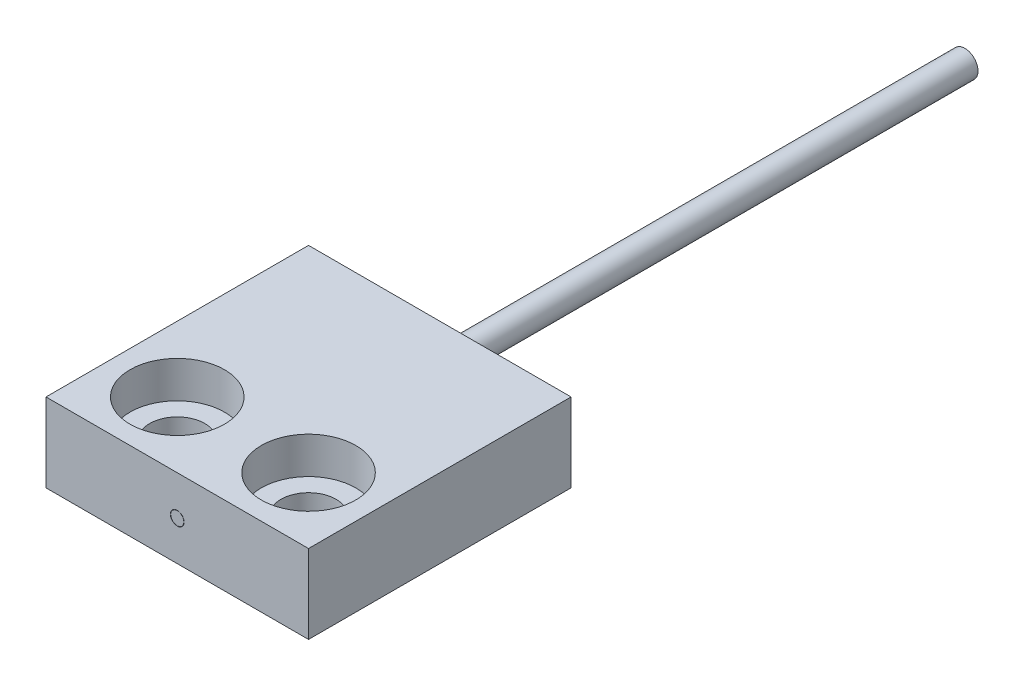
ISO-10303-21;
HEADER;
FILE_DESCRIPTION(('STEP AP214'),'2;1');
FILE_NAME('part.step','',(''),(''),'','','');
FILE_SCHEMA(('AUTOMOTIVE_DESIGN { 1 0 10303 214 1 1 1 1 }'));
ENDSEC;
DATA;
#1=APPLICATION_CONTEXT('core data for automotive mechanical design processes');
#2=APPLICATION_PROTOCOL_DEFINITION('international standard','automotive_design',2000,#1);
#3=PRODUCT_CONTEXT('',#1,'mechanical');
#4=PRODUCT('Part','Part','',(#3));
#5=PRODUCT_RELATED_PRODUCT_CATEGORY('part','',(#4));
#6=PRODUCT_DEFINITION_FORMATION('','',#4);
#7=PRODUCT_DEFINITION_CONTEXT('part definition',#1,'design');
#8=PRODUCT_DEFINITION('design','',#6,#7);
#9=PRODUCT_DEFINITION_SHAPE('','',#8);
#10=(LENGTH_UNIT() NAMED_UNIT(*) SI_UNIT(.MILLI.,.METRE.));
#11=(NAMED_UNIT(*) PLANE_ANGLE_UNIT() SI_UNIT($,.RADIAN.));
#12=(NAMED_UNIT(*) SI_UNIT($,.STERADIAN.) SOLID_ANGLE_UNIT());
#13=UNCERTAINTY_MEASURE_WITH_UNIT(LENGTH_MEASURE(1.E-05),#10,'distance_accuracy_value','');
#14=(GEOMETRIC_REPRESENTATION_CONTEXT(3) GLOBAL_UNCERTAINTY_ASSIGNED_CONTEXT((#13)) GLOBAL_UNIT_ASSIGNED_CONTEXT((#10,
#11,#12)) REPRESENTATION_CONTEXT('',''));
#15=CARTESIAN_POINT('',(0.,0.,0.));
#16=DIRECTION('',(0.,0.,1.));
#17=DIRECTION('',(1.,0.,0.));
#18=AXIS2_PLACEMENT_3D('',#15,#16,#17);
#19=CARTESIAN_POINT('',(20.,1.50000000000004,0.));
#20=DIRECTION('',(0.,0.,1.));
#21=DIRECTION('',(0.,-1.,0.));
#22=AXIS2_PLACEMENT_3D('',#19,#20,#21);
#23=PLANE('',#22);
#24=CARTESIAN_POINT('',(15.,0.,0.));
#25=DIRECTION('',(0.,0.,1.));
#26=DIRECTION('',(1.,0.,0.));
#27=AXIS2_PLACEMENT_3D('',#24,#25,#26);
#28=CIRCLE('',#27,0.25);
#29=CARTESIAN_POINT('',(15.25,0.,0.));
#30=VERTEX_POINT('',#29);
#31=EDGE_CURVE('E21',#30,#30,#28,.F.);
#32=ORIENTED_EDGE('',*,*,#31,.F.);
#33=EDGE_LOOP('',(#32));
#34=FACE_BOUND('',#33,.T.);
#35=ADVANCED_FACE('F17',(#34),#23,.T.);
#36=CARTESIAN_POINT('',(15.,0.,-10.735391052434));
#37=DIRECTION('',(0.,0.,1.));
#38=DIRECTION('',(1.,0.,0.));
#39=AXIS2_PLACEMENT_3D('',#36,#37,#38);
#40=CYLINDRICAL_SURFACE('',#39,0.25);
#41=ORIENTED_EDGE('',*,*,#31,.T.);
#42=EDGE_LOOP('',(#41));
#43=FACE_BOUND('',#42,.T.);
#44=CARTESIAN_POINT('',(15.,0.,-10.));
#45=DIRECTION('',(0.,0.,1.));
#46=DIRECTION('',(1.,0.,0.));
#47=AXIS2_PLACEMENT_3D('',#44,#45,#46);
#48=CIRCLE('',#47,0.25);
#49=CARTESIAN_POINT('',(15.25,0.,-10.));
#50=VERTEX_POINT('',#49);
#51=EDGE_CURVE('E128',#50,#50,#48,.T.);
#52=ORIENTED_EDGE('',*,*,#51,.T.);
#53=EDGE_LOOP('',(#52));
#54=FACE_BOUND('',#53,.T.);
#55=ADVANCED_FACE('F135',(#43,#54),#40,.T.);
#56=CARTESIAN_POINT('',(9.99999999999999,1.49999999999994,-10.));
#57=DIRECTION('',(0.,0.,-1.));
#58=DIRECTION('',(0.,1.,0.));
#59=AXIS2_PLACEMENT_3D('',#56,#57,#58);
#60=PLANE('',#59);
#61=CARTESIAN_POINT('',(15.,0.,-10.));
#62=DIRECTION('',(0.,0.,1.));
#63=DIRECTION('',(1.,0.,0.));
#64=AXIS2_PLACEMENT_3D('',#61,#62,#63);
#65=CIRCLE('',#64,0.26);
#66=CARTESIAN_POINT('',(15.26,0.,-10.));
#67=VERTEX_POINT('',#66);
#68=EDGE_CURVE('E123',#67,#67,#65,.T.);
#69=ORIENTED_EDGE('',*,*,#68,.T.);
#70=EDGE_LOOP('',(#69));
#71=FACE_BOUND('',#70,.T.);
#72=ORIENTED_EDGE('',*,*,#51,.F.);
#73=EDGE_LOOP('',(#72));
#74=FACE_BOUND('',#73,.T.);
#75=ADVANCED_FACE('F143',(#71,#74),#60,.F.);
#76=CARTESIAN_POINT('',(17.5,0.100000000000017,-2.5));
#77=DIRECTION('',(0.,1.,0.));
#78=DIRECTION('',(-1.,0.,0.));
#79=AXIS2_PLACEMENT_3D('',#76,#77,#78);
#80=CYLINDRICAL_SURFACE('',#79,1.8);
#81=CARTESIAN_POINT('',(17.5,0.100000000000017,-2.5));
#82=DIRECTION('',(0.,1.,0.));
#83=DIRECTION('',(-1.,0.,0.));
#84=AXIS2_PLACEMENT_3D('',#81,#82,#83);
#85=CIRCLE('',#84,1.8);
#86=CARTESIAN_POINT('',(15.7,0.100000000000005,-2.5));
#87=VERTEX_POINT('',#86);
#88=EDGE_CURVE('E126',#87,#87,#85,.T.);
#89=ORIENTED_EDGE('',*,*,#88,.F.);
#90=EDGE_LOOP('',(#89));
#91=FACE_BOUND('',#90,.T.);
#92=CARTESIAN_POINT('',(17.5,1.50000000000002,-2.50000000000001));
#93=DIRECTION('',(0.,1.,0.));
#94=DIRECTION('',(-1.,0.,0.));
#95=AXIS2_PLACEMENT_3D('',#92,#93,#94);
#96=CIRCLE('',#95,1.8);
#97=CARTESIAN_POINT('',(15.7,1.50000000000001,-2.50000000000001));
#98=VERTEX_POINT('',#97);
#99=EDGE_CURVE('E117',#98,#98,#96,.T.);
#100=ORIENTED_EDGE('',*,*,#99,.T.);
#101=EDGE_LOOP('',(#100));
#102=FACE_BOUND('',#101,.T.);
#103=ADVANCED_FACE('F210',(#91,#102),#80,.F.);
#104=CARTESIAN_POINT('',(15.,-1.04744500833281E-13,-30.));
#105=DIRECTION('',(0.,0.,-1.));
#106=DIRECTION('',(0.,1.,0.));
#107=AXIS2_PLACEMENT_3D('',#104,#105,#106);
#108=PLANE('',#107);
#109=CARTESIAN_POINT('',(15.,0.,-30.));
#110=DIRECTION('',(0.,0.,1.));
#111=DIRECTION('',(0.,-1.,0.));
#112=AXIS2_PLACEMENT_3D('',#109,#110,#111);
#113=CIRCLE('',#112,0.5);
#114=CARTESIAN_POINT('',(15.,-0.500000000000096,-30.));
#115=VERTEX_POINT('',#114);
#116=EDGE_CURVE('E114',#115,#115,#113,.T.);
#117=ORIENTED_EDGE('',*,*,#116,.F.);
#118=EDGE_LOOP('',(#117));
#119=FACE_BOUND('',#118,.T.);
#120=ADVANCED_FACE('F206',(#119),#108,.T.);
#121=CARTESIAN_POINT('',(12.5,0.0999999999999824,-2.5));
#122=DIRECTION('',(0.,1.,0.));
#123=DIRECTION('',(-1.,0.,0.));
#124=AXIS2_PLACEMENT_3D('',#121,#122,#123);
#125=CYLINDRICAL_SURFACE('',#124,1.8);
#126=CARTESIAN_POINT('',(12.5,1.49999999999998,-2.50000000000001));
#127=DIRECTION('',(0.,1.,0.));
#128=DIRECTION('',(-1.,0.,0.));
#129=AXIS2_PLACEMENT_3D('',#126,#127,#128);
#130=CIRCLE('',#129,1.8);
#131=CARTESIAN_POINT('',(10.7,1.49999999999997,-2.50000000000001));
#132=VERTEX_POINT('',#131);
#133=EDGE_CURVE('E120',#132,#132,#130,.T.);
#134=ORIENTED_EDGE('',*,*,#133,.T.);
#135=EDGE_LOOP('',(#134));
#136=FACE_BOUND('',#135,.T.);
#137=CARTESIAN_POINT('',(12.5,0.0999999999999824,-2.5));
#138=DIRECTION('',(0.,1.,0.));
#139=DIRECTION('',(-1.,0.,0.));
#140=AXIS2_PLACEMENT_3D('',#137,#138,#139);
#141=CIRCLE('',#140,1.8);
#142=CARTESIAN_POINT('',(10.7,0.0999999999999699,-2.5));
#143=VERTEX_POINT('',#142);
#144=EDGE_CURVE('E111',#143,#143,#141,.T.);
#145=ORIENTED_EDGE('',*,*,#144,.F.);
#146=EDGE_LOOP('',(#145));
#147=FACE_BOUND('',#146,.T.);
#148=ADVANCED_FACE('F202',(#136,#147),#125,.F.);
#149=CARTESIAN_POINT('',(17.5,0.100000000000017,-2.5));
#150=DIRECTION('',(0.,1.,0.));
#151=DIRECTION('',(-1.,0.,0.));
#152=AXIS2_PLACEMENT_3D('',#149,#150,#151);
#153=PLANE('',#152);
#154=CARTESIAN_POINT('',(17.5,0.100000000000017,-2.5));
#155=DIRECTION('',(0.,-1.,0.));
#156=DIRECTION('',(1.,0.,0.));
#157=AXIS2_PLACEMENT_3D('',#154,#155,#156);
#158=CIRCLE('',#157,1.05);
#159=CARTESIAN_POINT('',(18.55,0.100000000000025,-2.5));
#160=VERTEX_POINT('',#159);
#161=EDGE_CURVE('E77',#160,#160,#158,.T.);
#162=ORIENTED_EDGE('',*,*,#161,.T.);
#163=EDGE_LOOP('',(#162));
#164=FACE_BOUND('',#163,.T.);
#165=ORIENTED_EDGE('',*,*,#88,.T.);
#166=EDGE_LOOP('',(#165));
#167=FACE_BOUND('',#166,.T.);
#168=ADVANCED_FACE('F198',(#164,#167),#153,.T.);
#169=CARTESIAN_POINT('',(15.,0.,-10.735391052434));
#170=DIRECTION('',(0.,0.,1.));
#171=DIRECTION('',(1.,0.,0.));
#172=AXIS2_PLACEMENT_3D('',#169,#170,#171);
#173=CYLINDRICAL_SURFACE('',#172,0.26);
#174=ORIENTED_EDGE('',*,*,#68,.F.);
#175=EDGE_LOOP('',(#174));
#176=FACE_BOUND('',#175,.T.);
#177=CARTESIAN_POINT('',(15.,0.,0.));
#178=DIRECTION('',(0.,0.,1.));
#179=DIRECTION('',(1.,0.,0.));
#180=AXIS2_PLACEMENT_3D('',#177,#178,#179);
#181=CIRCLE('',#180,0.26);
#182=CARTESIAN_POINT('',(15.26,0.,0.));
#183=VERTEX_POINT('',#182);
#184=EDGE_CURVE('E82',#183,#183,#181,.F.);
#185=ORIENTED_EDGE('',*,*,#184,.F.);
#186=EDGE_LOOP('',(#185));
#187=FACE_BOUND('',#186,.T.);
#188=ADVANCED_FACE('F192',(#176,#187),#173,.F.);
#189=CARTESIAN_POINT('',(9.99999999999999,1.49999999999994,-10.));
#190=DIRECTION('',(0.,-1.,0.));
#191=DIRECTION('',(1.,0.,0.));
#192=AXIS2_PLACEMENT_3D('',#189,#190,#191);
#193=PLANE('',#192);
#194=ORIENTED_EDGE('',*,*,#99,.F.);
#195=EDGE_LOOP('',(#194));
#196=FACE_BOUND('',#195,.T.);
#197=ORIENTED_EDGE('',*,*,#133,.F.);
#198=EDGE_LOOP('',(#197));
#199=FACE_BOUND('',#198,.T.);
#200=DIRECTION('',(0.,0.,1.));
#201=VECTOR('',#200,1.);
#202=CARTESIAN_POINT('',(20.,1.49999999999999,-10.));
#203=LINE('',#202,#201);
#204=CARTESIAN_POINT('',(20.,1.49999999999999,-10.));
#205=VERTEX_POINT('',#204);
#206=CARTESIAN_POINT('',(20.,1.50000000000003,0.));
#207=VERTEX_POINT('',#206);
#208=EDGE_CURVE('E57',#205,#207,#203,.T.);
#209=ORIENTED_EDGE('',*,*,#208,.F.);
#210=DIRECTION('',(1.,0.,0.));
#211=VECTOR('',#210,1.);
#212=CARTESIAN_POINT('',(9.99999999999999,1.49999999999996,-10.));
#213=LINE('',#212,#211);
#214=CARTESIAN_POINT('',(9.99999999999999,1.49999999999995,-10.));
#215=VERTEX_POINT('',#214);
#216=EDGE_CURVE('E61',#215,#205,#213,.T.);
#217=ORIENTED_EDGE('',*,*,#216,.F.);
#218=DIRECTION('',(0.,0.,1.));
#219=VECTOR('',#218,1.);
#220=CARTESIAN_POINT('',(9.99999999999999,1.49999999999998,0.));
#221=LINE('',#220,#219);
#222=CARTESIAN_POINT('',(9.99999999999999,1.49999999999999,0.));
#223=VERTEX_POINT('',#222);
#224=EDGE_CURVE('E68',#223,#215,#221,.F.);
#225=ORIENTED_EDGE('',*,*,#224,.F.);
#226=DIRECTION('',(1.,0.,0.));
#227=VECTOR('',#226,1.);
#228=CARTESIAN_POINT('',(20.,1.50000000000003,0.));
#229=LINE('',#228,#227);
#230=EDGE_CURVE('E66',#207,#223,#229,.F.);
#231=ORIENTED_EDGE('',*,*,#230,.F.);
#232=EDGE_LOOP('',(#209,#217,#225,#231));
#233=FACE_BOUND('',#232,.T.);
#234=ADVANCED_FACE('F67',(#196,#199,#233),#193,.F.);
#235=CARTESIAN_POINT('',(15.,-3.75334461319259E-13,-110.));
#236=DIRECTION('',(0.,0.,1.));
#237=DIRECTION('',(0.,-1.,0.));
#238=AXIS2_PLACEMENT_3D('',#235,#236,#237);
#239=CYLINDRICAL_SURFACE('',#238,0.5);
#240=ORIENTED_EDGE('',*,*,#116,.T.);
#241=EDGE_LOOP('',(#240));
#242=FACE_BOUND('',#241,.T.);
#243=CARTESIAN_POINT('',(15.,0.,-9.99999999999999));
#244=DIRECTION('',(0.,0.,1.));
#245=DIRECTION('',(0.,-1.,0.));
#246=AXIS2_PLACEMENT_3D('',#243,#244,#245);
#247=CIRCLE('',#246,0.5);
#248=CARTESIAN_POINT('',(15.,-0.500000000000026,-9.99999999999999));
#249=VERTEX_POINT('',#248);
#250=EDGE_CURVE('E91',#249,#249,#247,.T.);
#251=ORIENTED_EDGE('',*,*,#250,.F.);
#252=EDGE_LOOP('',(#251));
#253=FACE_BOUND('',#252,.T.);
#254=ADVANCED_FACE('F168',(#242,#253),#239,.T.);
#255=CARTESIAN_POINT('',(12.5,0.0999999999999824,-2.5));
#256=DIRECTION('',(0.,1.,0.));
#257=DIRECTION('',(-1.,0.,0.));
#258=AXIS2_PLACEMENT_3D('',#255,#256,#257);
#259=PLANE('',#258);
#260=CARTESIAN_POINT('',(12.5,0.0999999999999825,-2.5));
#261=DIRECTION('',(0.,-1.,0.));
#262=DIRECTION('',(1.,0.,0.));
#263=AXIS2_PLACEMENT_3D('',#260,#261,#262);
#264=CIRCLE('',#263,1.05);
#265=CARTESIAN_POINT('',(13.55,0.0999999999999898,-2.5));
#266=VERTEX_POINT('',#265);
#267=EDGE_CURVE('E104',#266,#266,#264,.T.);
#268=ORIENTED_EDGE('',*,*,#267,.T.);
#269=EDGE_LOOP('',(#268));
#270=FACE_BOUND('',#269,.T.);
#271=ORIENTED_EDGE('',*,*,#144,.T.);
#272=EDGE_LOOP('',(#271));
#273=FACE_BOUND('',#272,.T.);
#274=ADVANCED_FACE('F160',(#270,#273),#259,.T.);
#275=CARTESIAN_POINT('',(17.5,1.50000000000002,-2.50000000000001));
#276=DIRECTION('',(0.,-1.,0.));
#277=DIRECTION('',(1.,0.,0.));
#278=AXIS2_PLACEMENT_3D('',#275,#276,#277);
#279=CYLINDRICAL_SURFACE('',#278,1.05);
#280=ORIENTED_EDGE('',*,*,#161,.F.);
#281=EDGE_LOOP('',(#280));
#282=FACE_BOUND('',#281,.T.);
#283=CARTESIAN_POINT('',(17.5,-1.49999999999998,-2.49999999999999));
#284=DIRECTION('',(0.,-1.,0.));
#285=DIRECTION('',(1.,0.,0.));
#286=AXIS2_PLACEMENT_3D('',#283,#284,#285);
#287=CIRCLE('',#286,1.05);
#288=CARTESIAN_POINT('',(18.55,-1.49999999999998,-2.49999999999999));
#289=VERTEX_POINT('',#288);
#290=EDGE_CURVE('E100',#289,#289,#287,.F.);
#291=ORIENTED_EDGE('',*,*,#290,.F.);
#292=EDGE_LOOP('',(#291));
#293=FACE_BOUND('',#292,.T.);
#294=ADVANCED_FACE('F158',(#282,#293),#279,.F.);
#295=CARTESIAN_POINT('',(20.,1.50000000000001,-10.));
#296=DIRECTION('',(1.,0.,0.));
#297=DIRECTION('',(0.,1.,0.));
#298=AXIS2_PLACEMENT_3D('',#295,#296,#297);
#299=PLANE('',#298);
#300=DIRECTION('',(0.,0.,1.));
#301=VECTOR('',#300,1.);
#302=CARTESIAN_POINT('',(20.,-1.49999999999999,-9.99999999999999));
#303=LINE('',#302,#301);
#304=CARTESIAN_POINT('',(20.,-1.49999999999998,-10.));
#305=VERTEX_POINT('',#304);
#306=CARTESIAN_POINT('',(20.,-1.49999999999998,0.));
#307=VERTEX_POINT('',#306);
#308=EDGE_CURVE('E49',#305,#307,#303,.T.);
#309=ORIENTED_EDGE('',*,*,#308,.F.);
#310=DIRECTION('',(0.,1.,0.));
#311=VECTOR('',#310,1.);
#312=CARTESIAN_POINT('',(20.,1.49999999999994,-10.));
#313=LINE('',#312,#311);
#314=EDGE_CURVE('E76',#205,#305,#313,.F.);
#315=ORIENTED_EDGE('',*,*,#314,.F.);
#316=ORIENTED_EDGE('',*,*,#208,.T.);
#317=DIRECTION('',(0.,-1.,0.));
#318=VECTOR('',#317,1.);
#319=CARTESIAN_POINT('',(20.,1.50000000000004,0.));
#320=LINE('',#319,#318);
#321=EDGE_CURVE('E72',#307,#207,#320,.F.);
#322=ORIENTED_EDGE('',*,*,#321,.F.);
#323=EDGE_LOOP('',(#309,#315,#316,#322));
#324=FACE_BOUND('',#323,.T.);
#325=ADVANCED_FACE('F74',(#324),#299,.T.);
#326=CARTESIAN_POINT('',(20.,1.50000000000004,0.));
#327=DIRECTION('',(0.,0.,1.));
#328=DIRECTION('',(0.,-1.,0.));
#329=AXIS2_PLACEMENT_3D('',#326,#327,#328);
#330=PLANE('',#329);
#331=ORIENTED_EDGE('',*,*,#184,.T.);
#332=EDGE_LOOP('',(#331));
#333=FACE_BOUND('',#332,.T.);
#334=DIRECTION('',(1.,0.,0.));
#335=VECTOR('',#334,1.);
#336=CARTESIAN_POINT('',(10.,-1.50000000000003,0.));
#337=LINE('',#336,#335);
#338=CARTESIAN_POINT('',(10.,-1.50000000000004,0.));
#339=VERTEX_POINT('',#338);
#340=EDGE_CURVE('E81',#307,#339,#337,.F.);
#341=ORIENTED_EDGE('',*,*,#340,.F.);
#342=ORIENTED_EDGE('',*,*,#321,.T.);
#343=ORIENTED_EDGE('',*,*,#230,.T.);
#344=DIRECTION('',(0.,-1.,0.));
#345=VECTOR('',#344,1.);
#346=CARTESIAN_POINT('',(9.99999999999999,1.49999999999997,0.));
#347=LINE('',#346,#345);
#348=EDGE_CURVE('E87',#339,#223,#347,.F.);
#349=ORIENTED_EDGE('',*,*,#348,.F.);
#350=EDGE_LOOP('',(#341,#342,#343,#349));
#351=FACE_BOUND('',#350,.T.);
#352=ADVANCED_FACE('F79',(#333,#351),#330,.T.);
#353=CARTESIAN_POINT('',(9.99999999999999,1.49999999999997,0.));
#354=DIRECTION('',(-1.,0.,0.));
#355=DIRECTION('',(0.,-1.,0.));
#356=AXIS2_PLACEMENT_3D('',#353,#354,#355);
#357=PLANE('',#356);
#358=DIRECTION('',(0.,0.,1.));
#359=VECTOR('',#358,1.);
#360=CARTESIAN_POINT('',(10.,-1.50000000000006,-9.99999999999999));
#361=LINE('',#360,#359);
#362=CARTESIAN_POINT('',(10.,-1.50000000000004,-10.));
#363=VERTEX_POINT('',#362);
#364=EDGE_CURVE('E96',#339,#363,#361,.F.);
#365=ORIENTED_EDGE('',*,*,#364,.F.);
#366=ORIENTED_EDGE('',*,*,#348,.T.);
#367=ORIENTED_EDGE('',*,*,#224,.T.);
#368=DIRECTION('',(0.,1.,0.));
#369=VECTOR('',#368,1.);
#370=CARTESIAN_POINT('',(10.,1.49999999999994,-10.));
#371=LINE('',#370,#369);
#372=EDGE_CURVE('E36',#363,#215,#371,.T.);
#373=ORIENTED_EDGE('',*,*,#372,.F.);
#374=EDGE_LOOP('',(#365,#366,#367,#373));
#375=FACE_BOUND('',#374,.T.);
#376=ADVANCED_FACE('F176',(#375),#357,.T.);
#377=CARTESIAN_POINT('',(9.99999999999999,1.49999999999994,-10.));
#378=DIRECTION('',(0.,0.,-1.));
#379=DIRECTION('',(0.,1.,0.));
#380=AXIS2_PLACEMENT_3D('',#377,#378,#379);
#381=PLANE('',#380);
#382=ORIENTED_EDGE('',*,*,#250,.T.);
#383=EDGE_LOOP('',(#382));
#384=FACE_BOUND('',#383,.T.);
#385=DIRECTION('',(1.,0.,0.));
#386=VECTOR('',#385,1.);
#387=CARTESIAN_POINT('',(10.,-1.50000000000006,-10.));
#388=LINE('',#387,#386);
#389=EDGE_CURVE('E27',#363,#305,#388,.T.);
#390=ORIENTED_EDGE('',*,*,#389,.F.);
#391=ORIENTED_EDGE('',*,*,#372,.T.);
#392=ORIENTED_EDGE('',*,*,#216,.T.);
#393=ORIENTED_EDGE('',*,*,#314,.T.);
#394=EDGE_LOOP('',(#390,#391,#392,#393));
#395=FACE_BOUND('',#394,.T.);
#396=ADVANCED_FACE('F151',(#384,#395),#381,.T.);
#397=CARTESIAN_POINT('',(12.5,1.49999999999998,-2.50000000000001));
#398=DIRECTION('',(0.,-1.,0.));
#399=DIRECTION('',(1.,0.,0.));
#400=AXIS2_PLACEMENT_3D('',#397,#398,#399);
#401=CYLINDRICAL_SURFACE('',#400,1.05);
#402=ORIENTED_EDGE('',*,*,#267,.F.);
#403=EDGE_LOOP('',(#402));
#404=FACE_BOUND('',#403,.T.);
#405=CARTESIAN_POINT('',(12.5,-1.50000000000002,-2.49999999999999));
#406=DIRECTION('',(0.,-1.,0.));
#407=DIRECTION('',(1.,0.,0.));
#408=AXIS2_PLACEMENT_3D('',#405,#406,#407);
#409=CIRCLE('',#408,1.05);
#410=CARTESIAN_POINT('',(13.55,-1.50000000000001,-2.49999999999999));
#411=VERTEX_POINT('',#410);
#412=EDGE_CURVE('E11',#411,#411,#409,.F.);
#413=ORIENTED_EDGE('',*,*,#412,.F.);
#414=EDGE_LOOP('',(#413));
#415=FACE_BOUND('',#414,.T.);
#416=ADVANCED_FACE('F146',(#404,#415),#401,.F.);
#417=CARTESIAN_POINT('',(10.,-1.50000000000006,-9.99999999999999));
#418=DIRECTION('',(0.,-1.,0.));
#419=DIRECTION('',(1.,0.,0.));
#420=AXIS2_PLACEMENT_3D('',#417,#418,#419);
#421=PLANE('',#420);
#422=ORIENTED_EDGE('',*,*,#412,.T.);
#423=EDGE_LOOP('',(#422));
#424=FACE_BOUND('',#423,.T.);
#425=ORIENTED_EDGE('',*,*,#364,.T.);
#426=ORIENTED_EDGE('',*,*,#389,.T.);
#427=ORIENTED_EDGE('',*,*,#308,.T.);
#428=ORIENTED_EDGE('',*,*,#340,.T.);
#429=EDGE_LOOP('',(#425,#426,#427,#428));
#430=FACE_BOUND('',#429,.T.);
#431=ORIENTED_EDGE('',*,*,#290,.T.);
#432=EDGE_LOOP('',(#431));
#433=FACE_BOUND('',#432,.T.);
#434=ADVANCED_FACE('F19',(#424,#430,#433),#421,.T.);
#435=CLOSED_SHELL('',(#35,#55,#75,#103,#120,#148,#168,#188,#234,#254,#274,#294,#325,#352,#376,
#396,#416,#434));
#436=MANIFOLD_SOLID_BREP('B1',#435);
#437=ADVANCED_BREP_SHAPE_REPRESENTATION('',(#18,#436),#14);
#438=SHAPE_DEFINITION_REPRESENTATION(#9,#437);
ENDSEC;
END-ISO-10303-21;
